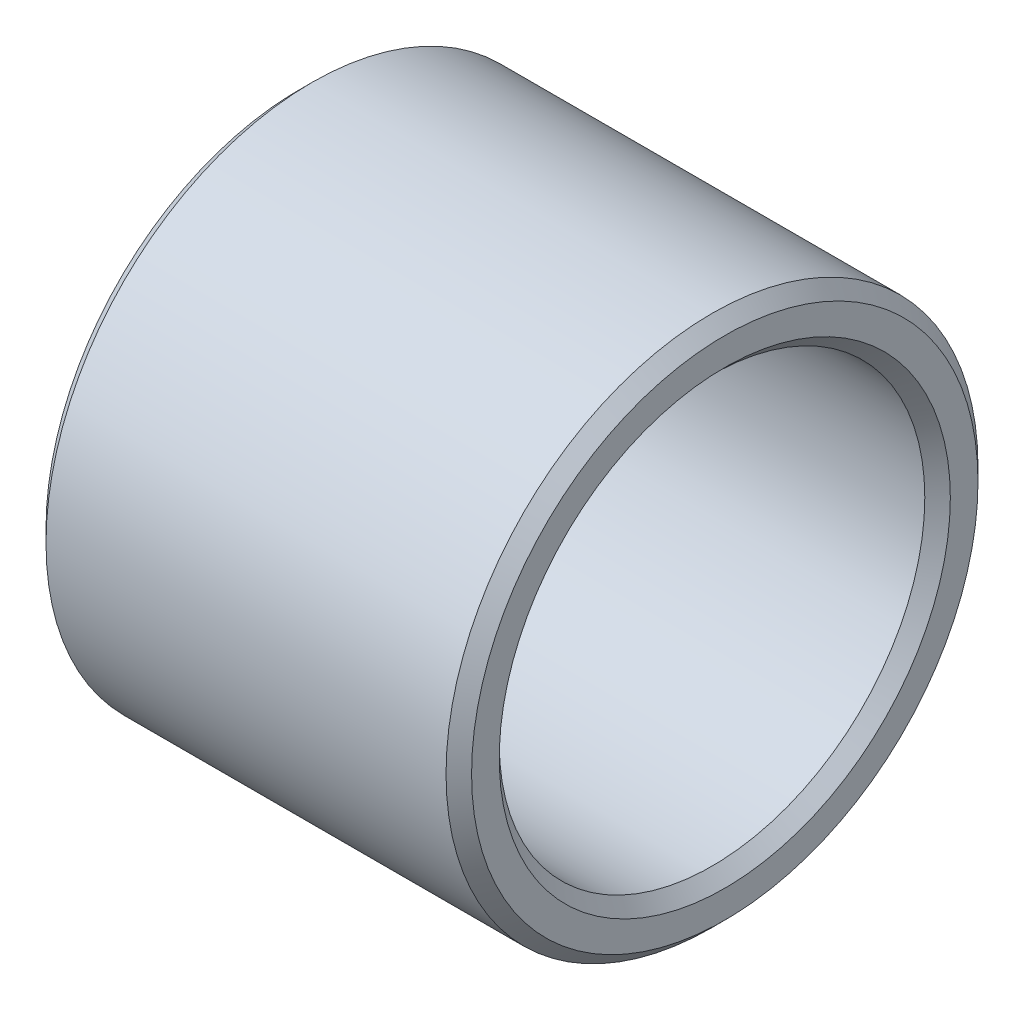
ISO-10303-21;
HEADER;
FILE_DESCRIPTION(('STEP AP214'),'2;1');
FILE_NAME('part.step','',(''),(''),'','','');
FILE_SCHEMA(('AUTOMOTIVE_DESIGN { 1 0 10303 214 1 1 1 1 }'));
ENDSEC;
DATA;
#1=APPLICATION_CONTEXT('core data for automotive mechanical design processes');
#2=APPLICATION_PROTOCOL_DEFINITION('international standard','automotive_design',2000,#1);
#3=PRODUCT_CONTEXT('',#1,'mechanical');
#4=PRODUCT('Part','Part','',(#3));
#5=PRODUCT_RELATED_PRODUCT_CATEGORY('part','',(#4));
#6=PRODUCT_DEFINITION_FORMATION('','',#4);
#7=PRODUCT_DEFINITION_CONTEXT('part definition',#1,'design');
#8=PRODUCT_DEFINITION('design','',#6,#7);
#9=PRODUCT_DEFINITION_SHAPE('','',#8);
#10=(LENGTH_UNIT() NAMED_UNIT(*) SI_UNIT(.MILLI.,.METRE.));
#11=(NAMED_UNIT(*) PLANE_ANGLE_UNIT() SI_UNIT($,.RADIAN.));
#12=(NAMED_UNIT(*) SI_UNIT($,.STERADIAN.) SOLID_ANGLE_UNIT());
#13=UNCERTAINTY_MEASURE_WITH_UNIT(LENGTH_MEASURE(1.E-05),#10,'distance_accuracy_value','');
#14=(GEOMETRIC_REPRESENTATION_CONTEXT(3) GLOBAL_UNCERTAINTY_ASSIGNED_CONTEXT((#13)) GLOBAL_UNIT_ASSIGNED_CONTEXT((#10,
#11,#12)) REPRESENTATION_CONTEXT('',''));
#15=CARTESIAN_POINT('',(0.,0.,0.));
#16=DIRECTION('',(0.,0.,1.));
#17=DIRECTION('',(1.,0.,0.));
#18=AXIS2_PLACEMENT_3D('',#15,#16,#17);
#19=CARTESIAN_POINT('',(25.4,0.,0.));
#20=DIRECTION('',(1.,0.,0.));
#21=DIRECTION('',(0.,0.,-1.));
#22=AXIS2_PLACEMENT_3D('',#19,#20,#21);
#23=PLANE('',#22);
#24=CARTESIAN_POINT('',(25.4,0.,0.));
#25=DIRECTION('',(1.,0.,0.));
#26=DIRECTION('',(0.,0.,-1.));
#27=AXIS2_PLACEMENT_3D('',#24,#25,#26);
#28=CIRCLE('',#27,13.462);
#29=CARTESIAN_POINT('',(25.4,0.,-13.462));
#30=VERTEX_POINT('',#29);
#31=EDGE_CURVE('E51',#30,#30,#28,.F.);
#32=ORIENTED_EDGE('',*,*,#31,.T.);
#33=EDGE_LOOP('',(#32));
#34=FACE_BOUND('',#33,.T.);
#35=CARTESIAN_POINT('',(25.4,0.,0.));
#36=DIRECTION('',(1.,0.,0.));
#37=DIRECTION('',(0.,0.,-1.));
#38=AXIS2_PLACEMENT_3D('',#35,#36,#37);
#39=CIRCLE('',#38,15.113);
#40=CARTESIAN_POINT('',(25.4,0.,-15.113));
#41=VERTEX_POINT('',#40);
#42=EDGE_CURVE('E54',#41,#41,#39,.T.);
#43=ORIENTED_EDGE('',*,*,#42,.T.);
#44=EDGE_LOOP('',(#43));
#45=FACE_BOUND('',#44,.T.);
#46=ADVANCED_FACE('F31',(#34,#45),#23,.T.);
#47=CARTESIAN_POINT('',(0.,0.,0.));
#48=DIRECTION('',(1.,0.,0.));
#49=DIRECTION('',(0.,0.,-1.));
#50=AXIS2_PLACEMENT_3D('',#47,#48,#49);
#51=PLANE('',#50);
#52=CARTESIAN_POINT('',(0.,0.,0.));
#53=DIRECTION('',(1.,0.,0.));
#54=DIRECTION('',(0.,0.,-1.));
#55=AXIS2_PLACEMENT_3D('',#52,#53,#54);
#56=CIRCLE('',#55,13.462);
#57=CARTESIAN_POINT('',(0.,0.,-13.462));
#58=VERTEX_POINT('',#57);
#59=EDGE_CURVE('E10',#58,#58,#56,.T.);
#60=ORIENTED_EDGE('',*,*,#59,.T.);
#61=EDGE_LOOP('',(#60));
#62=FACE_BOUND('',#61,.T.);
#63=CARTESIAN_POINT('',(0.,0.,0.));
#64=DIRECTION('',(1.,0.,0.));
#65=DIRECTION('',(0.,0.,-1.));
#66=AXIS2_PLACEMENT_3D('',#63,#64,#65);
#67=CIRCLE('',#66,15.113);
#68=CARTESIAN_POINT('',(0.,0.,-15.113));
#69=VERTEX_POINT('',#68);
#70=EDGE_CURVE('E38',#69,#69,#67,.F.);
#71=ORIENTED_EDGE('',*,*,#70,.T.);
#72=EDGE_LOOP('',(#71));
#73=FACE_BOUND('',#72,.T.);
#74=ADVANCED_FACE('F79',(#62,#73),#51,.F.);
#75=CARTESIAN_POINT('',(25.4,0.,0.));
#76=DIRECTION('',(-1.,0.,0.));
#77=DIRECTION('',(0.,0.,1.));
#78=AXIS2_PLACEMENT_3D('',#75,#76,#77);
#79=CYLINDRICAL_SURFACE('',#78,15.875);
#80=CARTESIAN_POINT('',(24.638,0.,0.));
#81=DIRECTION('',(1.,0.,0.));
#82=DIRECTION('',(0.,0.,-1.));
#83=AXIS2_PLACEMENT_3D('',#80,#81,#82);
#84=CIRCLE('',#83,15.875);
#85=CARTESIAN_POINT('',(24.638,0.,-15.875));
#86=VERTEX_POINT('',#85);
#87=EDGE_CURVE('E42',#86,#86,#84,.F.);
#88=ORIENTED_EDGE('',*,*,#87,.T.);
#89=EDGE_LOOP('',(#88));
#90=FACE_BOUND('',#89,.T.);
#91=CARTESIAN_POINT('',(0.761999999999999,0.,0.));
#92=DIRECTION('',(1.,0.,0.));
#93=DIRECTION('',(0.,0.,-1.));
#94=AXIS2_PLACEMENT_3D('',#91,#92,#93);
#95=CIRCLE('',#94,15.875);
#96=CARTESIAN_POINT('',(0.761999999999999,0.,-15.875));
#97=VERTEX_POINT('',#96);
#98=EDGE_CURVE('E46',#97,#97,#95,.T.);
#99=ORIENTED_EDGE('',*,*,#98,.T.);
#100=EDGE_LOOP('',(#99));
#101=FACE_BOUND('',#100,.T.);
#102=ADVANCED_FACE('F85',(#90,#101),#79,.T.);
#103=CARTESIAN_POINT('',(25.4,0.,0.));
#104=DIRECTION('',(-1.,0.,0.));
#105=DIRECTION('',(0.,0.,1.));
#106=AXIS2_PLACEMENT_3D('',#103,#104,#105);
#107=CYLINDRICAL_SURFACE('',#106,12.7);
#108=CARTESIAN_POINT('',(24.638,0.,0.));
#109=DIRECTION('',(1.,0.,0.));
#110=DIRECTION('',(0.,0.,-1.));
#111=AXIS2_PLACEMENT_3D('',#108,#109,#110);
#112=CIRCLE('',#111,12.7);
#113=CARTESIAN_POINT('',(24.638,0.,-12.7));
#114=VERTEX_POINT('',#113);
#115=EDGE_CURVE('E57',#114,#114,#112,.T.);
#116=ORIENTED_EDGE('',*,*,#115,.T.);
#117=EDGE_LOOP('',(#116));
#118=FACE_BOUND('',#117,.T.);
#119=CARTESIAN_POINT('',(0.761999999999995,0.,0.));
#120=DIRECTION('',(1.,0.,0.));
#121=DIRECTION('',(0.,0.,-1.));
#122=AXIS2_PLACEMENT_3D('',#119,#120,#121);
#123=CIRCLE('',#122,12.7);
#124=CARTESIAN_POINT('',(0.761999999999995,0.,-12.7));
#125=VERTEX_POINT('',#124);
#126=EDGE_CURVE('E60',#125,#125,#123,.F.);
#127=ORIENTED_EDGE('',*,*,#126,.T.);
#128=EDGE_LOOP('',(#127));
#129=FACE_BOUND('',#128,.T.);
#130=ADVANCED_FACE('F64',(#118,#129),#107,.F.);
#131=CARTESIAN_POINT('',(24.638,0.,0.));
#132=DIRECTION('',(1.,0.,0.));
#133=DIRECTION('',(0.,0.,-1.));
#134=AXIS2_PLACEMENT_3D('',#131,#132,#133);
#135=CONICAL_SURFACE('',#134,12.7,0.785398163397451);
#136=ORIENTED_EDGE('',*,*,#31,.F.);
#137=EDGE_LOOP('',(#136));
#138=FACE_BOUND('',#137,.T.);
#139=ORIENTED_EDGE('',*,*,#115,.F.);
#140=EDGE_LOOP('',(#139));
#141=FACE_BOUND('',#140,.T.);
#142=ADVANCED_FACE('F75',(#138,#141),#135,.F.);
#143=CARTESIAN_POINT('',(25.4,0.,0.));
#144=DIRECTION('',(-1.,0.,0.));
#145=DIRECTION('',(0.,0.,1.));
#146=AXIS2_PLACEMENT_3D('',#143,#144,#145);
#147=CONICAL_SURFACE('',#146,15.113,0.785398163397448);
#148=ORIENTED_EDGE('',*,*,#87,.F.);
#149=EDGE_LOOP('',(#148));
#150=FACE_BOUND('',#149,.T.);
#151=ORIENTED_EDGE('',*,*,#42,.F.);
#152=EDGE_LOOP('',(#151));
#153=FACE_BOUND('',#152,.T.);
#154=ADVANCED_FACE('F69',(#150,#153),#147,.T.);
#155=CARTESIAN_POINT('',(0.,0.,0.));
#156=DIRECTION('',(-1.,0.,0.));
#157=DIRECTION('',(0.,0.,1.));
#158=AXIS2_PLACEMENT_3D('',#155,#156,#157);
#159=CONICAL_SURFACE('',#158,13.462,0.785398163397444);
#160=ORIENTED_EDGE('',*,*,#126,.F.);
#161=EDGE_LOOP('',(#160));
#162=FACE_BOUND('',#161,.T.);
#163=ORIENTED_EDGE('',*,*,#59,.F.);
#164=EDGE_LOOP('',(#163));
#165=FACE_BOUND('',#164,.T.);
#166=ADVANCED_FACE('F66',(#162,#165),#159,.F.);
#167=CARTESIAN_POINT('',(0.761999999999999,0.,0.));
#168=DIRECTION('',(1.,0.,0.));
#169=DIRECTION('',(0.,0.,-1.));
#170=AXIS2_PLACEMENT_3D('',#167,#168,#169);
#171=CONICAL_SURFACE('',#170,15.875,0.785398163397451);
#172=ORIENTED_EDGE('',*,*,#70,.F.);
#173=EDGE_LOOP('',(#172));
#174=FACE_BOUND('',#173,.T.);
#175=ORIENTED_EDGE('',*,*,#98,.F.);
#176=EDGE_LOOP('',(#175));
#177=FACE_BOUND('',#176,.T.);
#178=ADVANCED_FACE('F33',(#174,#177),#171,.T.);
#179=CLOSED_SHELL('',(#46,#74,#102,#130,#142,#154,#166,#178));
#180=MANIFOLD_SOLID_BREP('B2',#179);
#181=ADVANCED_BREP_SHAPE_REPRESENTATION('',(#18,#180),#14);
#182=SHAPE_DEFINITION_REPRESENTATION(#9,#181);
ENDSEC;
END-ISO-10303-21;
